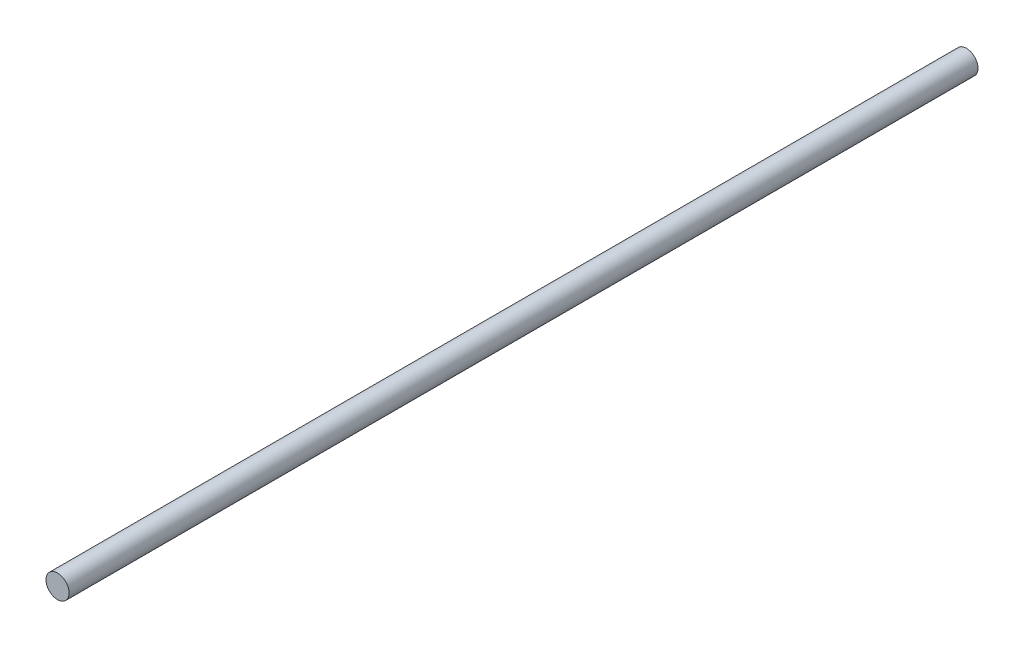
ISO-10303-21;
HEADER;
FILE_DESCRIPTION(('STEP AP214'),'2;1');
FILE_NAME('part.step','',(''),(''),'','','');
FILE_SCHEMA(('AUTOMOTIVE_DESIGN { 1 0 10303 214 1 1 1 1 }'));
ENDSEC;
DATA;
#1=APPLICATION_CONTEXT('core data for automotive mechanical design processes');
#2=APPLICATION_PROTOCOL_DEFINITION('international standard','automotive_design',2000,#1);
#3=PRODUCT_CONTEXT('',#1,'mechanical');
#4=PRODUCT('Part','Part','',(#3));
#5=PRODUCT_RELATED_PRODUCT_CATEGORY('part','',(#4));
#6=PRODUCT_DEFINITION_FORMATION('','',#4);
#7=PRODUCT_DEFINITION_CONTEXT('part definition',#1,'design');
#8=PRODUCT_DEFINITION('design','',#6,#7);
#9=PRODUCT_DEFINITION_SHAPE('','',#8);
#10=(LENGTH_UNIT() NAMED_UNIT(*) SI_UNIT(.MILLI.,.METRE.));
#11=(NAMED_UNIT(*) PLANE_ANGLE_UNIT() SI_UNIT($,.RADIAN.));
#12=(NAMED_UNIT(*) SI_UNIT($,.STERADIAN.) SOLID_ANGLE_UNIT());
#13=UNCERTAINTY_MEASURE_WITH_UNIT(LENGTH_MEASURE(1.E-05),#10,'distance_accuracy_value','');
#14=(GEOMETRIC_REPRESENTATION_CONTEXT(3) GLOBAL_UNCERTAINTY_ASSIGNED_CONTEXT((#13)) GLOBAL_UNIT_ASSIGNED_CONTEXT((#10,
#11,#12)) REPRESENTATION_CONTEXT('',''));
#15=CARTESIAN_POINT('',(0.,0.,0.));
#16=DIRECTION('',(0.,0.,1.));
#17=DIRECTION('',(1.,0.,0.));
#18=AXIS2_PLACEMENT_3D('',#15,#16,#17);
#19=CARTESIAN_POINT('',(0.,0.,118.));
#20=DIRECTION('',(0.,0.,-1.));
#21=DIRECTION('',(-1.,0.,0.));
#22=AXIS2_PLACEMENT_3D('',#19,#20,#21);
#23=CYLINDRICAL_SURFACE('',#22,1.5);
#24=CARTESIAN_POINT('',(0.,0.,118.));
#25=DIRECTION('',(0.,0.,1.));
#26=DIRECTION('',(1.,0.,0.));
#27=AXIS2_PLACEMENT_3D('',#24,#25,#26);
#28=CIRCLE('',#27,1.5);
#29=CARTESIAN_POINT('',(1.5,0.,118.));
#30=VERTEX_POINT('',#29);
#31=EDGE_CURVE('E10',#30,#30,#28,.T.);
#32=ORIENTED_EDGE('',*,*,#31,.F.);
#33=EDGE_LOOP('',(#32));
#34=FACE_BOUND('',#33,.T.);
#35=CARTESIAN_POINT('',(0.,0.,0.));
#36=DIRECTION('',(0.,0.,1.));
#37=DIRECTION('',(1.,0.,0.));
#38=AXIS2_PLACEMENT_3D('',#35,#36,#37);
#39=CIRCLE('',#38,1.5);
#40=CARTESIAN_POINT('',(1.5,0.,0.));
#41=VERTEX_POINT('',#40);
#42=EDGE_CURVE('E37',#41,#41,#39,.T.);
#43=ORIENTED_EDGE('',*,*,#42,.T.);
#44=EDGE_LOOP('',(#43));
#45=FACE_BOUND('',#44,.T.);
#46=ADVANCED_FACE('F34',(#34,#45),#23,.T.);
#47=CARTESIAN_POINT('',(0.,0.,118.));
#48=DIRECTION('',(0.,0.,1.));
#49=DIRECTION('',(1.,0.,0.));
#50=AXIS2_PLACEMENT_3D('',#47,#48,#49);
#51=PLANE('',#50);
#52=ORIENTED_EDGE('',*,*,#31,.T.);
#53=EDGE_LOOP('',(#52));
#54=FACE_BOUND('',#53,.T.);
#55=ADVANCED_FACE('F49',(#54),#51,.T.);
#56=CARTESIAN_POINT('',(0.,0.,0.));
#57=DIRECTION('',(0.,0.,1.));
#58=DIRECTION('',(1.,0.,0.));
#59=AXIS2_PLACEMENT_3D('',#56,#57,#58);
#60=PLANE('',#59);
#61=ORIENTED_EDGE('',*,*,#42,.F.);
#62=EDGE_LOOP('',(#61));
#63=FACE_BOUND('',#62,.T.);
#64=ADVANCED_FACE('F47',(#63),#60,.F.);
#65=CLOSED_SHELL('',(#46,#55,#64));
#66=MANIFOLD_SOLID_BREP('B2',#65);
#67=ADVANCED_BREP_SHAPE_REPRESENTATION('',(#18,#66),#14);
#68=SHAPE_DEFINITION_REPRESENTATION(#9,#67);
ENDSEC;
END-ISO-10303-21;
